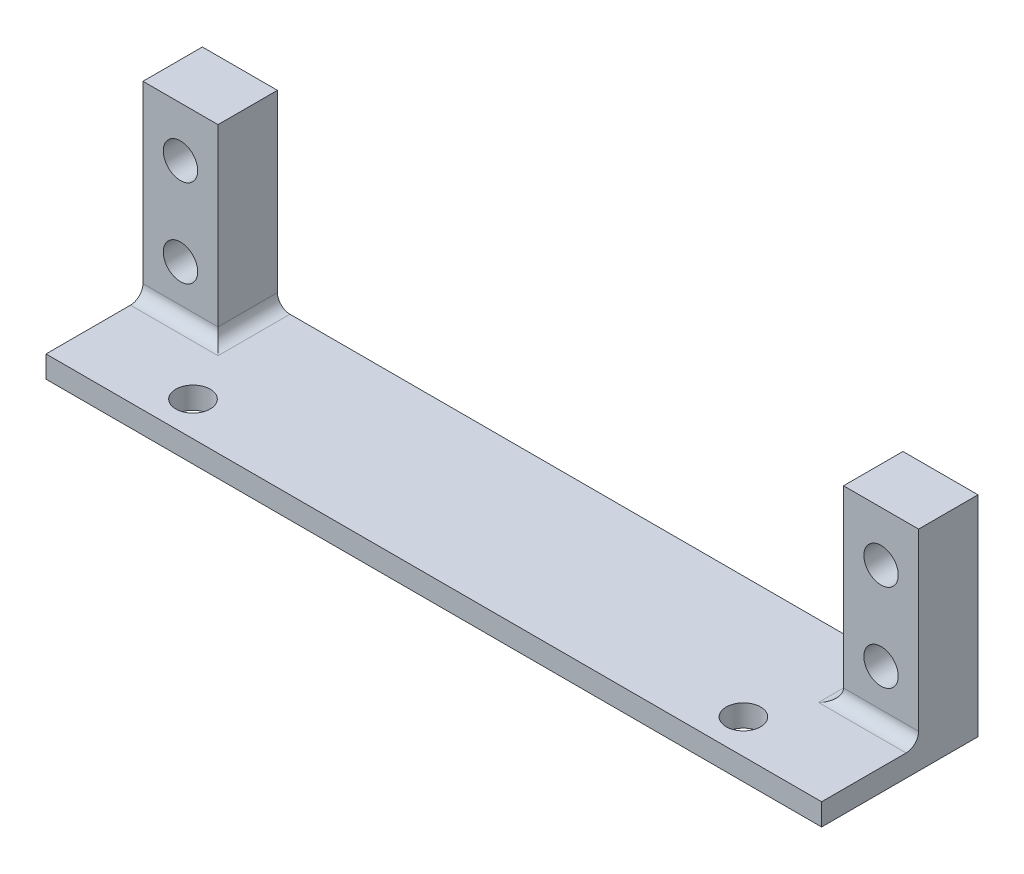
ISO-10303-21;
HEADER;
FILE_DESCRIPTION(('STEP AP214'),'2;1');
FILE_NAME('part.step','',(''),(''),'','','');
FILE_SCHEMA(('AUTOMOTIVE_DESIGN { 1 0 10303 214 1 1 1 1 }'));
ENDSEC;
DATA;
#1=APPLICATION_CONTEXT('core data for automotive mechanical design processes');
#2=APPLICATION_PROTOCOL_DEFINITION('international standard','automotive_design',2000,#1);
#3=PRODUCT_CONTEXT('',#1,'mechanical');
#4=PRODUCT('Part','Part','',(#3));
#5=PRODUCT_RELATED_PRODUCT_CATEGORY('part','',(#4));
#6=PRODUCT_DEFINITION_FORMATION('','',#4);
#7=PRODUCT_DEFINITION_CONTEXT('part definition',#1,'design');
#8=PRODUCT_DEFINITION('design','',#6,#7);
#9=PRODUCT_DEFINITION_SHAPE('','',#8);
#10=(LENGTH_UNIT() NAMED_UNIT(*) SI_UNIT(.MILLI.,.METRE.));
#11=(NAMED_UNIT(*) PLANE_ANGLE_UNIT() SI_UNIT($,.RADIAN.));
#12=(NAMED_UNIT(*) SI_UNIT($,.STERADIAN.) SOLID_ANGLE_UNIT());
#13=UNCERTAINTY_MEASURE_WITH_UNIT(LENGTH_MEASURE(1.E-05),#10,'distance_accuracy_value','');
#14=(GEOMETRIC_REPRESENTATION_CONTEXT(3) GLOBAL_UNCERTAINTY_ASSIGNED_CONTEXT((#13)) GLOBAL_UNIT_ASSIGNED_CONTEXT((#10,
#11,#12)) REPRESENTATION_CONTEXT('',''));
#15=CARTESIAN_POINT('',(0.,0.,0.));
#16=DIRECTION('',(0.,0.,1.));
#17=DIRECTION('',(1.,0.,0.));
#18=AXIS2_PLACEMENT_3D('',#15,#16,#17);
#19=CARTESIAN_POINT('',(0.,1.75,0.));
#20=DIRECTION('',(0.,0.,-1.));
#21=DIRECTION('',(-1.,0.,0.));
#22=AXIS2_PLACEMENT_3D('',#19,#20,#21);
#23=PLANE('',#22);
#24=DIRECTION('',(1.,0.,0.));
#25=VECTOR('',#24,1.);
#26=CARTESIAN_POINT('',(0.,0.,0.));
#27=LINE('',#26,#25);
#28=CARTESIAN_POINT('',(-6.,0.,0.));
#29=VERTEX_POINT('',#28);
#30=CARTESIAN_POINT('',(56.,0.,0.));
#31=VERTEX_POINT('',#30);
#32=EDGE_CURVE('E152',#29,#31,#27,.T.);
#33=ORIENTED_EDGE('',*,*,#32,.T.);
#34=DIRECTION('',(0.,-1.,0.));
#35=VECTOR('',#34,1.);
#36=CARTESIAN_POINT('',(56.,14.0610722522451,0.));
#37=LINE('',#36,#35);
#38=CARTESIAN_POINT('',(56.,1.75,0.));
#39=VERTEX_POINT('',#38);
#40=EDGE_CURVE('E155',#39,#31,#37,.T.);
#41=ORIENTED_EDGE('',*,*,#40,.F.);
#42=DIRECTION('',(1.,0.,0.));
#43=VECTOR('',#42,1.);
#44=CARTESIAN_POINT('',(0.,1.75,0.));
#45=LINE('',#44,#43);
#46=CARTESIAN_POINT('',(-6.,1.75,0.));
#47=VERTEX_POINT('',#46);
#48=EDGE_CURVE('E296',#47,#39,#45,.T.);
#49=ORIENTED_EDGE('',*,*,#48,.F.);
#50=DIRECTION('',(0.,-1.,0.));
#51=VECTOR('',#50,1.);
#52=CARTESIAN_POINT('',(-6.,14.0610722522451,0.));
#53=LINE('',#52,#51);
#54=EDGE_CURVE('E157',#47,#29,#53,.T.);
#55=ORIENTED_EDGE('',*,*,#54,.T.);
#56=EDGE_LOOP('',(#33,#41,#49,#55));
#57=FACE_BOUND('',#56,.T.);
#58=ADVANCED_FACE('F54',(#57),#23,.F.);
#59=CARTESIAN_POINT('',(0.,1.75,-12.5));
#60=DIRECTION('',(0.,0.,1.));
#61=DIRECTION('',(1.,0.,0.));
#62=AXIS2_PLACEMENT_3D('',#59,#60,#61);
#63=PLANE('',#62);
#64=DIRECTION('',(-1.,0.,0.));
#65=VECTOR('',#64,1.);
#66=CARTESIAN_POINT('',(0.,0.,-12.5));
#67=LINE('',#66,#65);
#68=CARTESIAN_POINT('',(56.,0.,-12.5));
#69=VERTEX_POINT('',#68);
#70=CARTESIAN_POINT('',(-6.,0.,-12.5));
#71=VERTEX_POINT('',#70);
#72=EDGE_CURVE('E162',#69,#71,#67,.T.);
#73=ORIENTED_EDGE('',*,*,#72,.T.);
#74=DIRECTION('',(0.,1.,0.));
#75=VECTOR('',#74,1.);
#76=CARTESIAN_POINT('',(-6.,0.,-12.5));
#77=LINE('',#76,#75);
#78=CARTESIAN_POINT('',(-6.,16.75,-12.5));
#79=VERTEX_POINT('',#78);
#80=EDGE_CURVE('E264',#71,#79,#77,.T.);
#81=ORIENTED_EDGE('',*,*,#80,.T.);
#82=DIRECTION('',(1.,0.,0.));
#83=VECTOR('',#82,1.);
#84=CARTESIAN_POINT('',(0.,16.75,-12.5));
#85=LINE('',#84,#83);
#86=CARTESIAN_POINT('',(0.,16.75,-12.5));
#87=VERTEX_POINT('',#86);
#88=EDGE_CURVE('E268',#79,#87,#85,.T.);
#89=ORIENTED_EDGE('',*,*,#88,.T.);
#90=DIRECTION('',(0.,-1.,0.));
#91=VECTOR('',#90,1.);
#92=CARTESIAN_POINT('',(0.,0.,-12.5));
#93=LINE('',#92,#91);
#94=CARTESIAN_POINT('',(0.,2.75,-12.5));
#95=VERTEX_POINT('',#94);
#96=EDGE_CURVE('E260',#87,#95,#93,.T.);
#97=ORIENTED_EDGE('',*,*,#96,.T.);
#98=CARTESIAN_POINT('',(1.,2.75,-12.5));
#99=DIRECTION('',(0.,0.,1.));
#100=DIRECTION('',(1.,0.,0.));
#101=AXIS2_PLACEMENT_3D('',#98,#99,#100);
#102=CIRCLE('',#101,1.);
#103=CARTESIAN_POINT('',(1.,1.75,-12.5));
#104=VERTEX_POINT('',#103);
#105=EDGE_CURVE('E64',#95,#104,#102,.T.);
#106=ORIENTED_EDGE('',*,*,#105,.T.);
#107=DIRECTION('',(-1.,0.,0.));
#108=VECTOR('',#107,1.);
#109=CARTESIAN_POINT('',(0.,1.75,-12.5));
#110=LINE('',#109,#108);
#111=CARTESIAN_POINT('',(49.,1.75,-12.5));
#112=VERTEX_POINT('',#111);
#113=EDGE_CURVE('E299',#112,#104,#110,.T.);
#114=ORIENTED_EDGE('',*,*,#113,.F.);
#115=CARTESIAN_POINT('',(49.,2.75,-12.5));
#116=DIRECTION('',(0.,0.,1.));
#117=DIRECTION('',(1.,0.,0.));
#118=AXIS2_PLACEMENT_3D('',#115,#116,#117);
#119=CIRCLE('',#118,1.);
#120=CARTESIAN_POINT('',(50.,2.75,-12.5));
#121=VERTEX_POINT('',#120);
#122=EDGE_CURVE('E330',#112,#121,#119,.T.);
#123=ORIENTED_EDGE('',*,*,#122,.T.);
#124=DIRECTION('',(0.,1.,0.));
#125=VECTOR('',#124,1.);
#126=CARTESIAN_POINT('',(50.,0.,-12.5));
#127=LINE('',#126,#125);
#128=CARTESIAN_POINT('',(50.,16.75,-12.5));
#129=VERTEX_POINT('',#128);
#130=EDGE_CURVE('E237',#121,#129,#127,.T.);
#131=ORIENTED_EDGE('',*,*,#130,.T.);
#132=DIRECTION('',(1.,0.,0.));
#133=VECTOR('',#132,1.);
#134=CARTESIAN_POINT('',(50.,16.75,-12.5));
#135=LINE('',#134,#133);
#136=CARTESIAN_POINT('',(56.,16.75,-12.5));
#137=VERTEX_POINT('',#136);
#138=EDGE_CURVE('E240',#129,#137,#135,.T.);
#139=ORIENTED_EDGE('',*,*,#138,.T.);
#140=DIRECTION('',(0.,-1.,0.));
#141=VECTOR('',#140,1.);
#142=CARTESIAN_POINT('',(56.,0.,-12.5));
#143=LINE('',#142,#141);
#144=EDGE_CURVE('E244',#137,#69,#143,.T.);
#145=ORIENTED_EDGE('',*,*,#144,.T.);
#146=EDGE_LOOP('',(#73,#81,#89,#97,#106,#114,#123,#131,#139,#145));
#147=FACE_BOUND('',#146,.T.);
#148=CARTESIAN_POINT('',(-3.,5.75,-12.5));
#149=DIRECTION('',(0.,0.,-1.));
#150=DIRECTION('',(-1.,0.,0.));
#151=AXIS2_PLACEMENT_3D('',#148,#149,#150);
#152=CIRCLE('',#151,1.375);
#153=CARTESIAN_POINT('',(-4.375,5.75,-12.5));
#154=VERTEX_POINT('',#153);
#155=EDGE_CURVE('E173',#154,#154,#152,.T.);
#156=ORIENTED_EDGE('',*,*,#155,.F.);
#157=EDGE_LOOP('',(#156));
#158=FACE_BOUND('',#157,.T.);
#159=CARTESIAN_POINT('',(-3.,12.75,-12.5));
#160=DIRECTION('',(0.,0.,-1.));
#161=DIRECTION('',(-1.,0.,0.));
#162=AXIS2_PLACEMENT_3D('',#159,#160,#161);
#163=CIRCLE('',#162,1.375);
#164=CARTESIAN_POINT('',(-4.375,12.75,-12.5));
#165=VERTEX_POINT('',#164);
#166=EDGE_CURVE('E256',#165,#165,#163,.T.);
#167=ORIENTED_EDGE('',*,*,#166,.F.);
#168=EDGE_LOOP('',(#167));
#169=FACE_BOUND('',#168,.T.);
#170=CARTESIAN_POINT('',(53.,5.75,-12.5));
#171=DIRECTION('',(0.,0.,-1.));
#172=DIRECTION('',(1.,0.,0.));
#173=AXIS2_PLACEMENT_3D('',#170,#171,#172);
#174=CIRCLE('',#173,1.375);
#175=CARTESIAN_POINT('',(54.375,5.75,-12.5));
#176=VERTEX_POINT('',#175);
#177=EDGE_CURVE('E229',#176,#176,#174,.T.);
#178=ORIENTED_EDGE('',*,*,#177,.F.);
#179=EDGE_LOOP('',(#178));
#180=FACE_BOUND('',#179,.T.);
#181=CARTESIAN_POINT('',(53.,12.75,-12.5));
#182=DIRECTION('',(0.,0.,-1.));
#183=DIRECTION('',(1.,0.,0.));
#184=AXIS2_PLACEMENT_3D('',#181,#182,#183);
#185=CIRCLE('',#184,1.375);
#186=CARTESIAN_POINT('',(54.375,12.75,-12.5));
#187=VERTEX_POINT('',#186);
#188=EDGE_CURVE('E233',#187,#187,#185,.T.);
#189=ORIENTED_EDGE('',*,*,#188,.F.);
#190=EDGE_LOOP('',(#189));
#191=FACE_BOUND('',#190,.T.);
#192=ADVANCED_FACE('F359',(#147,#158,#169,#180,#191),#63,.F.);
#193=CARTESIAN_POINT('',(0.,1.75,0.));
#194=DIRECTION('',(0.,-1.,0.));
#195=DIRECTION('',(0.,0.,-1.));
#196=AXIS2_PLACEMENT_3D('',#193,#194,#195);
#197=PLANE('',#196);
#198=CARTESIAN_POINT('',(3.,1.75,-2.75));
#199=DIRECTION('',(0.,1.,0.));
#200=DIRECTION('',(0.,0.,1.));
#201=AXIS2_PLACEMENT_3D('',#198,#199,#200);
#202=CIRCLE('',#201,1.375);
#203=CARTESIAN_POINT('',(3.,1.75,-1.375));
#204=VERTEX_POINT('',#203);
#205=EDGE_CURVE('E285',#204,#204,#202,.T.);
#206=ORIENTED_EDGE('',*,*,#205,.F.);
#207=EDGE_LOOP('',(#206));
#208=FACE_BOUND('',#207,.T.);
#209=CARTESIAN_POINT('',(47.,1.75,-2.75));
#210=DIRECTION('',(0.,1.,0.));
#211=DIRECTION('',(0.,0.,-1.));
#212=AXIS2_PLACEMENT_3D('',#209,#210,#211);
#213=CIRCLE('',#212,1.375);
#214=CARTESIAN_POINT('',(47.,1.75,-4.125));
#215=VERTEX_POINT('',#214);
#216=EDGE_CURVE('E276',#215,#215,#213,.T.);
#217=ORIENTED_EDGE('',*,*,#216,.F.);
#218=EDGE_LOOP('',(#217));
#219=FACE_BOUND('',#218,.T.);
#220=DIRECTION('',(1.,0.,0.));
#221=VECTOR('',#220,1.);
#222=CARTESIAN_POINT('',(0.,1.75,-6.75));
#223=LINE('',#222,#221);
#224=CARTESIAN_POINT('',(56.,1.75,-6.75));
#225=VERTEX_POINT('',#224);
#226=CARTESIAN_POINT('',(49.,1.75,-6.75));
#227=VERTEX_POINT('',#226);
#228=EDGE_CURVE('E312',#225,#227,#223,.F.);
#229=ORIENTED_EDGE('',*,*,#228,.T.);
#230=DIRECTION('',(0.,0.,-1.));
#231=VECTOR('',#230,1.);
#232=CARTESIAN_POINT('',(49.,1.75,0.));
#233=LINE('',#232,#231);
#234=EDGE_CURVE('E315',#227,#112,#233,.T.);
#235=ORIENTED_EDGE('',*,*,#234,.T.);
#236=ORIENTED_EDGE('',*,*,#113,.T.);
#237=DIRECTION('',(0.,0.,1.));
#238=VECTOR('',#237,1.);
#239=CARTESIAN_POINT('',(1.,1.75,0.));
#240=LINE('',#239,#238);
#241=CARTESIAN_POINT('',(1.,1.75,-6.75));
#242=VERTEX_POINT('',#241);
#243=EDGE_CURVE('E308',#104,#242,#240,.T.);
#244=ORIENTED_EDGE('',*,*,#243,.T.);
#245=DIRECTION('',(1.,0.,0.));
#246=VECTOR('',#245,1.);
#247=CARTESIAN_POINT('',(0.,1.75,-6.75));
#248=LINE('',#247,#246);
#249=CARTESIAN_POINT('',(-6.,1.75,-6.75));
#250=VERTEX_POINT('',#249);
#251=EDGE_CURVE('E302',#242,#250,#248,.F.);
#252=ORIENTED_EDGE('',*,*,#251,.T.);
#253=DIRECTION('',(0.,0.,-1.));
#254=VECTOR('',#253,1.);
#255=CARTESIAN_POINT('',(-6.,1.75,-10.75));
#256=LINE('',#255,#254);
#257=EDGE_CURVE('E185',#47,#250,#256,.T.);
#258=ORIENTED_EDGE('',*,*,#257,.F.);
#259=ORIENTED_EDGE('',*,*,#48,.T.);
#260=DIRECTION('',(0.,0.,1.));
#261=VECTOR('',#260,1.);
#262=CARTESIAN_POINT('',(56.,1.75,-10.75));
#263=LINE('',#262,#261);
#264=EDGE_CURVE('E178',#225,#39,#263,.T.);
#265=ORIENTED_EDGE('',*,*,#264,.F.);
#266=EDGE_LOOP('',(#229,#235,#236,#244,#252,#258,#259,#265));
#267=FACE_BOUND('',#266,.T.);
#268=ADVANCED_FACE('F356',(#208,#219,#267),#197,.F.);
#269=CARTESIAN_POINT('',(0.,0.,0.));
#270=DIRECTION('',(0.,-1.,0.));
#271=DIRECTION('',(0.,0.,-1.));
#272=AXIS2_PLACEMENT_3D('',#269,#270,#271);
#273=PLANE('',#272);
#274=ORIENTED_EDGE('',*,*,#32,.F.);
#275=DIRECTION('',(0.,0.,-1.));
#276=VECTOR('',#275,1.);
#277=CARTESIAN_POINT('',(-6.,0.,-10.75));
#278=LINE('',#277,#276);
#279=EDGE_CURVE('E272',#29,#71,#278,.T.);
#280=ORIENTED_EDGE('',*,*,#279,.T.);
#281=ORIENTED_EDGE('',*,*,#72,.F.);
#282=DIRECTION('',(0.,0.,-1.));
#283=VECTOR('',#282,1.);
#284=CARTESIAN_POINT('',(56.,0.,-10.75));
#285=LINE('',#284,#283);
#286=EDGE_CURVE('E166',#31,#69,#285,.T.);
#287=ORIENTED_EDGE('',*,*,#286,.F.);
#288=EDGE_LOOP('',(#274,#280,#281,#287));
#289=FACE_BOUND('',#288,.T.);
#290=CARTESIAN_POINT('',(3.,0.,-2.75));
#291=DIRECTION('',(0.,1.,0.));
#292=DIRECTION('',(0.,0.,1.));
#293=AXIS2_PLACEMENT_3D('',#290,#291,#292);
#294=CIRCLE('',#293,1.375);
#295=CARTESIAN_POINT('',(3.,0.,-1.375));
#296=VERTEX_POINT('',#295);
#297=EDGE_CURVE('E163',#296,#296,#294,.T.);
#298=ORIENTED_EDGE('',*,*,#297,.T.);
#299=EDGE_LOOP('',(#298));
#300=FACE_BOUND('',#299,.T.);
#301=CARTESIAN_POINT('',(47.,0.,-2.75));
#302=DIRECTION('',(0.,1.,0.));
#303=DIRECTION('',(0.,0.,-1.));
#304=AXIS2_PLACEMENT_3D('',#301,#302,#303);
#305=CIRCLE('',#304,1.375);
#306=CARTESIAN_POINT('',(47.,0.,-4.125));
#307=VERTEX_POINT('',#306);
#308=EDGE_CURVE('E289',#307,#307,#305,.T.);
#309=ORIENTED_EDGE('',*,*,#308,.T.);
#310=EDGE_LOOP('',(#309));
#311=FACE_BOUND('',#310,.T.);
#312=ADVANCED_FACE('F167',(#289,#300,#311),#273,.T.);
#313=CARTESIAN_POINT('',(47.,0.,-2.75));
#314=DIRECTION('',(0.,1.,0.));
#315=DIRECTION('',(0.,0.,1.));
#316=AXIS2_PLACEMENT_3D('',#313,#314,#315);
#317=CYLINDRICAL_SURFACE('',#316,1.375);
#318=ORIENTED_EDGE('',*,*,#308,.F.);
#319=EDGE_LOOP('',(#318));
#320=FACE_BOUND('',#319,.T.);
#321=ORIENTED_EDGE('',*,*,#216,.T.);
#322=EDGE_LOOP('',(#321));
#323=FACE_BOUND('',#322,.T.);
#324=ADVANCED_FACE('F506',(#320,#323),#317,.F.);
#325=CARTESIAN_POINT('',(3.,0.,-2.75));
#326=DIRECTION('',(0.,1.,0.));
#327=DIRECTION('',(0.,0.,1.));
#328=AXIS2_PLACEMENT_3D('',#325,#326,#327);
#329=CYLINDRICAL_SURFACE('',#328,1.375);
#330=ORIENTED_EDGE('',*,*,#297,.F.);
#331=EDGE_LOOP('',(#330));
#332=FACE_BOUND('',#331,.T.);
#333=ORIENTED_EDGE('',*,*,#205,.T.);
#334=EDGE_LOOP('',(#333));
#335=FACE_BOUND('',#334,.T.);
#336=ADVANCED_FACE('F498',(#332,#335),#329,.F.);
#337=CARTESIAN_POINT('',(0.,0.,-10.75));
#338=DIRECTION('',(1.,0.,0.));
#339=DIRECTION('',(0.,0.,-1.));
#340=AXIS2_PLACEMENT_3D('',#337,#338,#339);
#341=PLANE('',#340);
#342=DIRECTION('',(0.,1.,0.));
#343=VECTOR('',#342,1.);
#344=CARTESIAN_POINT('',(0.,1.75,-7.75));
#345=LINE('',#344,#343);
#346=CARTESIAN_POINT('',(0.,2.75,-7.75));
#347=VERTEX_POINT('',#346);
#348=CARTESIAN_POINT('',(0.,16.75,-7.75));
#349=VERTEX_POINT('',#348);
#350=EDGE_CURVE('E226',#347,#349,#345,.T.);
#351=ORIENTED_EDGE('',*,*,#350,.F.);
#352=DIRECTION('',(0.,0.,1.));
#353=VECTOR('',#352,1.);
#354=CARTESIAN_POINT('',(0.,2.75,-10.75));
#355=LINE('',#354,#353);
#356=EDGE_CURVE('E325',#347,#95,#355,.F.);
#357=ORIENTED_EDGE('',*,*,#356,.T.);
#358=ORIENTED_EDGE('',*,*,#96,.F.);
#359=DIRECTION('',(0.,0.,-1.));
#360=VECTOR('',#359,1.);
#361=CARTESIAN_POINT('',(0.,16.75,-10.75));
#362=LINE('',#361,#360);
#363=EDGE_CURVE('E273',#349,#87,#362,.T.);
#364=ORIENTED_EDGE('',*,*,#363,.F.);
#365=EDGE_LOOP('',(#351,#357,#358,#364));
#366=FACE_BOUND('',#365,.T.);
#367=ADVANCED_FACE('F366',(#366),#341,.T.);
#368=CARTESIAN_POINT('',(0.,16.75,-10.75));
#369=DIRECTION('',(0.,1.,0.));
#370=DIRECTION('',(0.,0.,1.));
#371=AXIS2_PLACEMENT_3D('',#368,#369,#370);
#372=PLANE('',#371);
#373=ORIENTED_EDGE('',*,*,#88,.F.);
#374=DIRECTION('',(0.,0.,-1.));
#375=VECTOR('',#374,1.);
#376=CARTESIAN_POINT('',(-6.,16.75,-10.75));
#377=LINE('',#376,#375);
#378=CARTESIAN_POINT('',(-6.,16.75,-7.75));
#379=VERTEX_POINT('',#378);
#380=EDGE_CURVE('E277',#379,#79,#377,.T.);
#381=ORIENTED_EDGE('',*,*,#380,.F.);
#382=DIRECTION('',(-1.,0.,0.));
#383=VECTOR('',#382,1.);
#384=CARTESIAN_POINT('',(0.,16.75,-7.75));
#385=LINE('',#384,#383);
#386=EDGE_CURVE('E219',#349,#379,#385,.T.);
#387=ORIENTED_EDGE('',*,*,#386,.F.);
#388=ORIENTED_EDGE('',*,*,#363,.T.);
#389=EDGE_LOOP('',(#373,#381,#387,#388));
#390=FACE_BOUND('',#389,.T.);
#391=ADVANCED_FACE('F371',(#390),#372,.T.);
#392=CARTESIAN_POINT('',(-6.,0.,-10.75));
#393=DIRECTION('',(-1.,0.,0.));
#394=DIRECTION('',(0.,0.,1.));
#395=AXIS2_PLACEMENT_3D('',#392,#393,#394);
#396=PLANE('',#395);
#397=ORIENTED_EDGE('',*,*,#80,.F.);
#398=ORIENTED_EDGE('',*,*,#279,.F.);
#399=ORIENTED_EDGE('',*,*,#54,.F.);
#400=ORIENTED_EDGE('',*,*,#257,.T.);
#401=CARTESIAN_POINT('',(-6.,2.75,-6.75));
#402=DIRECTION('',(-1.,0.,0.));
#403=DIRECTION('',(0.,0.,1.));
#404=AXIS2_PLACEMENT_3D('',#401,#402,#403);
#405=CIRCLE('',#404,1.);
#406=CARTESIAN_POINT('',(-6.,2.75,-7.75));
#407=VERTEX_POINT('',#406);
#408=EDGE_CURVE('E13',#250,#407,#405,.F.);
#409=ORIENTED_EDGE('',*,*,#408,.T.);
#410=DIRECTION('',(0.,-1.,0.));
#411=VECTOR('',#410,1.);
#412=CARTESIAN_POINT('',(-6.,16.75,-7.75));
#413=LINE('',#412,#411);
#414=EDGE_CURVE('E223',#379,#407,#413,.T.);
#415=ORIENTED_EDGE('',*,*,#414,.F.);
#416=ORIENTED_EDGE('',*,*,#380,.T.);
#417=EDGE_LOOP('',(#397,#398,#399,#400,#409,#415,#416));
#418=FACE_BOUND('',#417,.T.);
#419=ADVANCED_FACE('F373',(#418),#396,.T.);
#420=CARTESIAN_POINT('',(-3.,12.75,-10.75));
#421=DIRECTION('',(0.,0.,-1.));
#422=DIRECTION('',(-1.,0.,0.));
#423=AXIS2_PLACEMENT_3D('',#420,#421,#422);
#424=CYLINDRICAL_SURFACE('',#423,1.375);
#425=ORIENTED_EDGE('',*,*,#166,.T.);
#426=EDGE_LOOP('',(#425));
#427=FACE_BOUND('',#426,.T.);
#428=CARTESIAN_POINT('',(-3.,12.75,-7.75));
#429=DIRECTION('',(0.,0.,1.));
#430=DIRECTION('',(1.,0.,0.));
#431=AXIS2_PLACEMENT_3D('',#428,#429,#430);
#432=CIRCLE('',#431,1.375);
#433=CARTESIAN_POINT('',(-1.625,12.75,-7.75));
#434=VERTEX_POINT('',#433);
#435=EDGE_CURVE('E211',#434,#434,#432,.T.);
#436=ORIENTED_EDGE('',*,*,#435,.T.);
#437=EDGE_LOOP('',(#436));
#438=FACE_BOUND('',#437,.T.);
#439=ADVANCED_FACE('F375',(#427,#438),#424,.F.);
#440=CARTESIAN_POINT('',(-3.,5.75,-10.75));
#441=DIRECTION('',(0.,0.,-1.));
#442=DIRECTION('',(-1.,0.,0.));
#443=AXIS2_PLACEMENT_3D('',#440,#441,#442);
#444=CYLINDRICAL_SURFACE('',#443,1.375);
#445=ORIENTED_EDGE('',*,*,#155,.T.);
#446=EDGE_LOOP('',(#445));
#447=FACE_BOUND('',#446,.T.);
#448=CARTESIAN_POINT('',(-3.,5.75,-7.75));
#449=DIRECTION('',(0.,0.,1.));
#450=DIRECTION('',(1.,0.,0.));
#451=AXIS2_PLACEMENT_3D('',#448,#449,#450);
#452=CIRCLE('',#451,1.375);
#453=CARTESIAN_POINT('',(-1.625,5.75,-7.75));
#454=VERTEX_POINT('',#453);
#455=EDGE_CURVE('E215',#454,#454,#452,.T.);
#456=ORIENTED_EDGE('',*,*,#455,.T.);
#457=EDGE_LOOP('',(#456));
#458=FACE_BOUND('',#457,.T.);
#459=ADVANCED_FACE('F381',(#447,#458),#444,.F.);
#460=CARTESIAN_POINT('',(50.,0.,-10.75));
#461=DIRECTION('',(-1.,0.,0.));
#462=DIRECTION('',(0.,0.,1.));
#463=AXIS2_PLACEMENT_3D('',#460,#461,#462);
#464=PLANE('',#463);
#465=ORIENTED_EDGE('',*,*,#130,.F.);
#466=DIRECTION('',(0.,0.,-1.));
#467=VECTOR('',#466,1.);
#468=CARTESIAN_POINT('',(50.,2.75,-10.75));
#469=LINE('',#468,#467);
#470=CARTESIAN_POINT('',(50.,2.75,-7.75));
#471=VERTEX_POINT('',#470);
#472=EDGE_CURVE('E319',#121,#471,#469,.F.);
#473=ORIENTED_EDGE('',*,*,#472,.T.);
#474=DIRECTION('',(0.,-1.,0.));
#475=VECTOR('',#474,1.);
#476=CARTESIAN_POINT('',(50.,16.75,-7.75));
#477=LINE('',#476,#475);
#478=CARTESIAN_POINT('',(50.,16.75,-7.75));
#479=VERTEX_POINT('',#478);
#480=EDGE_CURVE('E200',#479,#471,#477,.T.);
#481=ORIENTED_EDGE('',*,*,#480,.F.);
#482=DIRECTION('',(0.,0.,-1.));
#483=VECTOR('',#482,1.);
#484=CARTESIAN_POINT('',(50.,16.75,-10.75));
#485=LINE('',#484,#483);
#486=EDGE_CURVE('E246',#479,#129,#485,.T.);
#487=ORIENTED_EDGE('',*,*,#486,.T.);
#488=EDGE_LOOP('',(#465,#473,#481,#487));
#489=FACE_BOUND('',#488,.T.);
#490=ADVANCED_FACE('F459',(#489),#464,.T.);
#491=CARTESIAN_POINT('',(56.,0.,-10.75));
#492=DIRECTION('',(1.,0.,0.));
#493=DIRECTION('',(0.,0.,-1.));
#494=AXIS2_PLACEMENT_3D('',#491,#492,#493);
#495=PLANE('',#494);
#496=ORIENTED_EDGE('',*,*,#144,.F.);
#497=DIRECTION('',(0.,0.,-1.));
#498=VECTOR('',#497,1.);
#499=CARTESIAN_POINT('',(56.,16.75,-10.75));
#500=LINE('',#499,#498);
#501=CARTESIAN_POINT('',(56.,16.75,-7.75));
#502=VERTEX_POINT('',#501);
#503=EDGE_CURVE('E174',#502,#137,#500,.T.);
#504=ORIENTED_EDGE('',*,*,#503,.F.);
#505=DIRECTION('',(0.,1.,0.));
#506=VECTOR('',#505,1.);
#507=CARTESIAN_POINT('',(56.,1.75,-7.75));
#508=LINE('',#507,#506);
#509=CARTESIAN_POINT('',(56.,2.75,-7.75));
#510=VERTEX_POINT('',#509);
#511=EDGE_CURVE('E204',#510,#502,#508,.T.);
#512=ORIENTED_EDGE('',*,*,#511,.F.);
#513=CARTESIAN_POINT('',(56.,2.75,-6.75));
#514=DIRECTION('',(1.,0.,0.));
#515=DIRECTION('',(0.,0.,-1.));
#516=AXIS2_PLACEMENT_3D('',#513,#514,#515);
#517=CIRCLE('',#516,1.);
#518=EDGE_CURVE('E333',#510,#225,#517,.F.);
#519=ORIENTED_EDGE('',*,*,#518,.T.);
#520=ORIENTED_EDGE('',*,*,#264,.T.);
#521=ORIENTED_EDGE('',*,*,#40,.T.);
#522=ORIENTED_EDGE('',*,*,#286,.T.);
#523=EDGE_LOOP('',(#496,#504,#512,#519,#520,#521,#522));
#524=FACE_BOUND('',#523,.T.);
#525=ADVANCED_FACE('F176',(#524),#495,.T.);
#526=CARTESIAN_POINT('',(50.,16.75,-10.75));
#527=DIRECTION('',(0.,1.,0.));
#528=DIRECTION('',(0.,0.,1.));
#529=AXIS2_PLACEMENT_3D('',#526,#527,#528);
#530=PLANE('',#529);
#531=ORIENTED_EDGE('',*,*,#138,.F.);
#532=ORIENTED_EDGE('',*,*,#486,.F.);
#533=DIRECTION('',(-1.,0.,0.));
#534=VECTOR('',#533,1.);
#535=CARTESIAN_POINT('',(56.,16.75,-7.75));
#536=LINE('',#535,#534);
#537=EDGE_CURVE('E207',#502,#479,#536,.T.);
#538=ORIENTED_EDGE('',*,*,#537,.F.);
#539=ORIENTED_EDGE('',*,*,#503,.T.);
#540=EDGE_LOOP('',(#531,#532,#538,#539));
#541=FACE_BOUND('',#540,.T.);
#542=ADVANCED_FACE('F444',(#541),#530,.T.);
#543=CARTESIAN_POINT('',(53.,12.75,-10.75));
#544=DIRECTION('',(0.,0.,-1.));
#545=DIRECTION('',(-1.,0.,0.));
#546=AXIS2_PLACEMENT_3D('',#543,#544,#545);
#547=CYLINDRICAL_SURFACE('',#546,1.375);
#548=ORIENTED_EDGE('',*,*,#188,.T.);
#549=EDGE_LOOP('',(#548));
#550=FACE_BOUND('',#549,.T.);
#551=CARTESIAN_POINT('',(53.,12.75,-7.75));
#552=DIRECTION('',(0.,0.,1.));
#553=DIRECTION('',(1.,0.,0.));
#554=AXIS2_PLACEMENT_3D('',#551,#552,#553);
#555=CIRCLE('',#554,1.375);
#556=CARTESIAN_POINT('',(54.375,12.75,-7.75));
#557=VERTEX_POINT('',#556);
#558=EDGE_CURVE('E191',#557,#557,#555,.T.);
#559=ORIENTED_EDGE('',*,*,#558,.T.);
#560=EDGE_LOOP('',(#559));
#561=FACE_BOUND('',#560,.T.);
#562=ADVANCED_FACE('F436',(#550,#561),#547,.F.);
#563=CARTESIAN_POINT('',(53.,5.75,-10.75));
#564=DIRECTION('',(0.,0.,-1.));
#565=DIRECTION('',(-1.,0.,0.));
#566=AXIS2_PLACEMENT_3D('',#563,#564,#565);
#567=CYLINDRICAL_SURFACE('',#566,1.375);
#568=ORIENTED_EDGE('',*,*,#177,.T.);
#569=EDGE_LOOP('',(#568));
#570=FACE_BOUND('',#569,.T.);
#571=CARTESIAN_POINT('',(53.,5.75,-7.75));
#572=DIRECTION('',(0.,0.,1.));
#573=DIRECTION('',(1.,0.,0.));
#574=AXIS2_PLACEMENT_3D('',#571,#572,#573);
#575=CIRCLE('',#574,1.375);
#576=CARTESIAN_POINT('',(54.375,5.75,-7.75));
#577=VERTEX_POINT('',#576);
#578=EDGE_CURVE('E196',#577,#577,#575,.T.);
#579=ORIENTED_EDGE('',*,*,#578,.T.);
#580=EDGE_LOOP('',(#579));
#581=FACE_BOUND('',#580,.T.);
#582=ADVANCED_FACE('F428',(#570,#581),#567,.F.);
#583=CARTESIAN_POINT('',(0.,0.,-7.75));
#584=DIRECTION('',(0.,0.,1.));
#585=DIRECTION('',(1.,0.,0.));
#586=AXIS2_PLACEMENT_3D('',#583,#584,#585);
#587=PLANE('',#586);
#588=ORIENTED_EDGE('',*,*,#455,.F.);
#589=EDGE_LOOP('',(#588));
#590=FACE_BOUND('',#589,.T.);
#591=ORIENTED_EDGE('',*,*,#414,.T.);
#592=DIRECTION('',(1.,0.,0.));
#593=VECTOR('',#592,1.);
#594=CARTESIAN_POINT('',(0.,2.75,-7.75));
#595=LINE('',#594,#593);
#596=EDGE_CURVE('E77',#407,#347,#595,.T.);
#597=ORIENTED_EDGE('',*,*,#596,.T.);
#598=ORIENTED_EDGE('',*,*,#350,.T.);
#599=ORIENTED_EDGE('',*,*,#386,.T.);
#600=EDGE_LOOP('',(#591,#597,#598,#599));
#601=FACE_BOUND('',#600,.T.);
#602=ORIENTED_EDGE('',*,*,#435,.F.);
#603=EDGE_LOOP('',(#602));
#604=FACE_BOUND('',#603,.T.);
#605=ADVANCED_FACE('F368',(#590,#601,#604),#587,.T.);
#606=CARTESIAN_POINT('',(0.,0.,-7.75));
#607=DIRECTION('',(0.,0.,1.));
#608=DIRECTION('',(1.,0.,0.));
#609=AXIS2_PLACEMENT_3D('',#606,#607,#608);
#610=PLANE('',#609);
#611=ORIENTED_EDGE('',*,*,#578,.F.);
#612=EDGE_LOOP('',(#611));
#613=FACE_BOUND('',#612,.T.);
#614=ORIENTED_EDGE('',*,*,#480,.T.);
#615=DIRECTION('',(1.,0.,0.));
#616=VECTOR('',#615,1.);
#617=CARTESIAN_POINT('',(0.,2.75,-7.75));
#618=LINE('',#617,#616);
#619=EDGE_CURVE('E322',#471,#510,#618,.T.);
#620=ORIENTED_EDGE('',*,*,#619,.T.);
#621=ORIENTED_EDGE('',*,*,#511,.T.);
#622=ORIENTED_EDGE('',*,*,#537,.T.);
#623=EDGE_LOOP('',(#614,#620,#621,#622));
#624=FACE_BOUND('',#623,.T.);
#625=ORIENTED_EDGE('',*,*,#558,.F.);
#626=EDGE_LOOP('',(#625));
#627=FACE_BOUND('',#626,.T.);
#628=ADVANCED_FACE('F399',(#613,#624,#627),#610,.T.);
#629=CARTESIAN_POINT('',(0.,2.75,-6.75));
#630=DIRECTION('',(1.,0.,0.));
#631=DIRECTION('',(0.,0.,-1.));
#632=AXIS2_PLACEMENT_3D('',#629,#630,#631);
#633=CYLINDRICAL_SURFACE('',#632,1.);
#634=ORIENTED_EDGE('',*,*,#518,.F.);
#635=ORIENTED_EDGE('',*,*,#619,.F.);
#636=CARTESIAN_POINT('',(49.,2.75,-6.75));
#637=DIRECTION('',(0.707106781186547,0.,0.707106781186547));
#638=DIRECTION('',(0.707106781186547,0.,-0.707106781186547));
#639=AXIS2_PLACEMENT_3D('',#636,#637,#638);
#640=ELLIPSE('',#639,1.41421356237309,1.);
#641=EDGE_CURVE('E187',#227,#471,#640,.T.);
#642=ORIENTED_EDGE('',*,*,#641,.F.);
#643=ORIENTED_EDGE('',*,*,#228,.F.);
#644=EDGE_LOOP('',(#634,#635,#642,#643));
#645=FACE_BOUND('',#644,.T.);
#646=ADVANCED_FACE('F397',(#645),#633,.F.);
#647=CARTESIAN_POINT('',(49.,2.75,0.));
#648=DIRECTION('',(0.,0.,-1.));
#649=DIRECTION('',(-1.,0.,0.));
#650=AXIS2_PLACEMENT_3D('',#647,#648,#649);
#651=CYLINDRICAL_SURFACE('',#650,1.);
#652=ORIENTED_EDGE('',*,*,#641,.T.);
#653=ORIENTED_EDGE('',*,*,#472,.F.);
#654=ORIENTED_EDGE('',*,*,#122,.F.);
#655=ORIENTED_EDGE('',*,*,#234,.F.);
#656=EDGE_LOOP('',(#652,#653,#654,#655));
#657=FACE_BOUND('',#656,.T.);
#658=ADVANCED_FACE('F394',(#657),#651,.F.);
#659=CARTESIAN_POINT('',(0.,2.75,-6.75));
#660=DIRECTION('',(1.,0.,0.));
#661=DIRECTION('',(0.,0.,-1.));
#662=AXIS2_PLACEMENT_3D('',#659,#660,#661);
#663=CYLINDRICAL_SURFACE('',#662,1.);
#664=ORIENTED_EDGE('',*,*,#408,.F.);
#665=ORIENTED_EDGE('',*,*,#251,.F.);
#666=CARTESIAN_POINT('',(1.,2.75,-6.75));
#667=DIRECTION('',(0.707106781186547,0.,-0.707106781186547));
#668=DIRECTION('',(0.707106781186547,0.,0.707106781186547));
#669=AXIS2_PLACEMENT_3D('',#666,#667,#668);
#670=ELLIPSE('',#669,1.41421356237309,1.);
#671=EDGE_CURVE('E58',#347,#242,#670,.F.);
#672=ORIENTED_EDGE('',*,*,#671,.F.);
#673=ORIENTED_EDGE('',*,*,#596,.F.);
#674=EDGE_LOOP('',(#664,#665,#672,#673));
#675=FACE_BOUND('',#674,.T.);
#676=ADVANCED_FACE('F56',(#675),#663,.F.);
#677=CARTESIAN_POINT('',(1.,2.75,0.));
#678=DIRECTION('',(0.,0.,1.));
#679=DIRECTION('',(1.,0.,0.));
#680=AXIS2_PLACEMENT_3D('',#677,#678,#679);
#681=CYLINDRICAL_SURFACE('',#680,1.);
#682=ORIENTED_EDGE('',*,*,#105,.F.);
#683=ORIENTED_EDGE('',*,*,#356,.F.);
#684=ORIENTED_EDGE('',*,*,#671,.T.);
#685=ORIENTED_EDGE('',*,*,#243,.F.);
#686=EDGE_LOOP('',(#682,#683,#684,#685));
#687=FACE_BOUND('',#686,.T.);
#688=ADVANCED_FACE('F352',(#687),#681,.F.);
#689=CLOSED_SHELL('',(#58,#192,#268,#312,#324,#336,#367,#391,#419,#439,#459,#490,#525,#542,#562,
#582,#605,#628,#646,#658,#676,#688));
#690=MANIFOLD_SOLID_BREP('B2',#689);
#691=ADVANCED_BREP_SHAPE_REPRESENTATION('',(#18,#690),#14);
#692=SHAPE_DEFINITION_REPRESENTATION(#9,#691);
ENDSEC;
END-ISO-10303-21;
